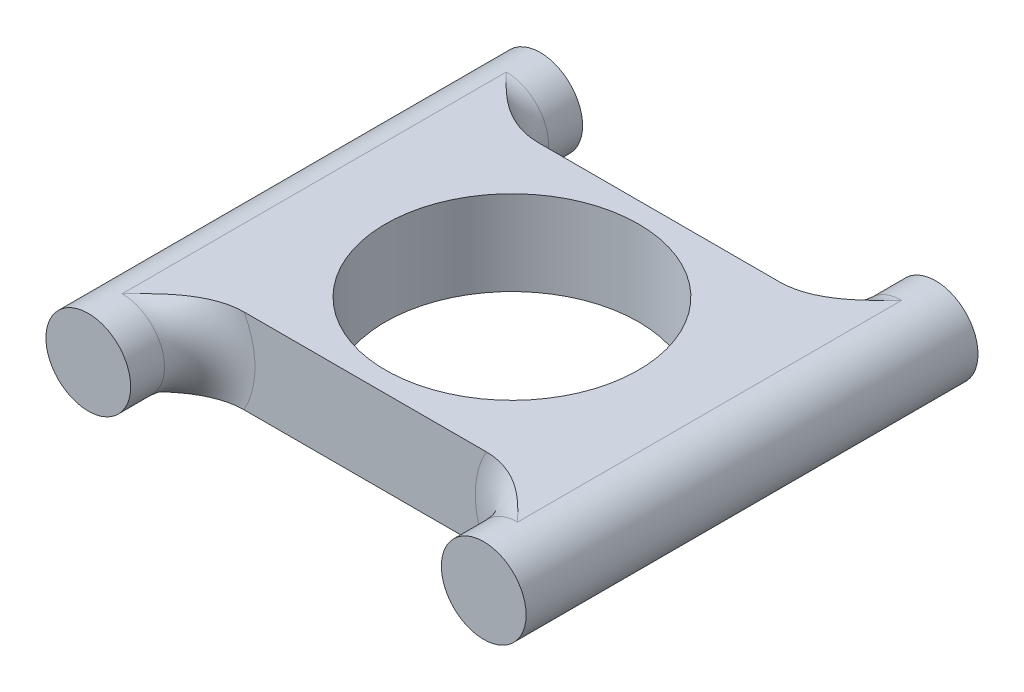
ISO-10303-21;
HEADER;
FILE_DESCRIPTION(('STEP AP214'),'2;1');
FILE_NAME('part.step','',(''),(''),'','','');
FILE_SCHEMA(('AUTOMOTIVE_DESIGN { 1 0 10303 214 1 1 1 1 }'));
ENDSEC;
DATA;
#1=APPLICATION_CONTEXT('core data for automotive mechanical design processes');
#2=APPLICATION_PROTOCOL_DEFINITION('international standard','automotive_design',2000,#1);
#3=PRODUCT_CONTEXT('',#1,'mechanical');
#4=PRODUCT('Part','Part','',(#3));
#5=PRODUCT_RELATED_PRODUCT_CATEGORY('part','',(#4));
#6=PRODUCT_DEFINITION_FORMATION('','',#4);
#7=PRODUCT_DEFINITION_CONTEXT('part definition',#1,'design');
#8=PRODUCT_DEFINITION('design','',#6,#7);
#9=PRODUCT_DEFINITION_SHAPE('','',#8);
#10=(LENGTH_UNIT() NAMED_UNIT(*) SI_UNIT(.MILLI.,.METRE.));
#11=(NAMED_UNIT(*) PLANE_ANGLE_UNIT() SI_UNIT($,.RADIAN.));
#12=(NAMED_UNIT(*) SI_UNIT($,.STERADIAN.) SOLID_ANGLE_UNIT());
#13=UNCERTAINTY_MEASURE_WITH_UNIT(LENGTH_MEASURE(1.E-05),#10,'distance_accuracy_value','');
#14=(GEOMETRIC_REPRESENTATION_CONTEXT(3) GLOBAL_UNCERTAINTY_ASSIGNED_CONTEXT((#13)) GLOBAL_UNIT_ASSIGNED_CONTEXT((#10,
#11,#12)) REPRESENTATION_CONTEXT('',''));
#15=CARTESIAN_POINT('',(0.,0.,0.));
#16=DIRECTION('',(0.,0.,1.));
#17=DIRECTION('',(1.,0.,0.));
#18=AXIS2_PLACEMENT_3D('',#15,#16,#17);
#19=CARTESIAN_POINT('',(22.225,0.,-25.4));
#20=DIRECTION('',(0.,0.,1.));
#21=DIRECTION('',(1.,0.,0.));
#22=AXIS2_PLACEMENT_3D('',#19,#20,#21);
#23=CYLINDRICAL_SURFACE('',#22,4.7625);
#24=CARTESIAN_POINT('',(22.225,0.,-25.4));
#25=DIRECTION('',(0.,0.,1.));
#26=DIRECTION('',(1.,0.,0.));
#27=AXIS2_PLACEMENT_3D('',#24,#25,#26);
#28=CIRCLE('',#27,4.7625);
#29=CARTESIAN_POINT('',(26.9875,0.,-25.4));
#30=VERTEX_POINT('',#29);
#31=EDGE_CURVE('E122',#30,#30,#28,.T.);
#32=ORIENTED_EDGE('',*,*,#31,.T.);
#33=EDGE_LOOP('',(#32));
#34=FACE_BOUND('',#33,.T.);
#35=CARTESIAN_POINT('',(22.225,0.,25.4));
#36=DIRECTION('',(0.,0.,1.));
#37=DIRECTION('',(1.,0.,0.));
#38=AXIS2_PLACEMENT_3D('',#35,#36,#37);
#39=CIRCLE('',#38,4.7625);
#40=CARTESIAN_POINT('',(26.9875,0.,25.4));
#41=VERTEX_POINT('',#40);
#42=EDGE_CURVE('E208',#41,#41,#39,.T.);
#43=ORIENTED_EDGE('',*,*,#42,.F.);
#44=EDGE_LOOP('',(#43));
#45=FACE_BOUND('',#44,.T.);
#46=CARTESIAN_POINT('',(22.225,0.,21.59));
#47=DIRECTION('',(0.,0.,1.));
#48=DIRECTION('',(1.,0.,0.));
#49=AXIS2_PLACEMENT_3D('',#46,#47,#48);
#50=CIRCLE('',#49,4.7625);
#51=CARTESIAN_POINT('',(22.225,4.7625,21.59));
#52=VERTEX_POINT('',#51);
#53=CARTESIAN_POINT('',(22.225,-4.7625,21.59));
#54=VERTEX_POINT('',#53);
#55=EDGE_CURVE('E121',#52,#54,#50,.T.);
#56=ORIENTED_EDGE('',*,*,#55,.T.);
#57=DIRECTION('',(0.,0.,1.));
#58=VECTOR('',#57,1.);
#59=CARTESIAN_POINT('',(22.225,-4.7625,-16.51));
#60=LINE('',#59,#58);
#61=CARTESIAN_POINT('',(22.225,-4.7625,-21.59));
#62=VERTEX_POINT('',#61);
#63=EDGE_CURVE('E118',#62,#54,#60,.T.);
#64=ORIENTED_EDGE('',*,*,#63,.F.);
#65=CARTESIAN_POINT('',(22.225,0.,-21.59));
#66=DIRECTION('',(0.,0.,1.));
#67=DIRECTION('',(1.,0.,0.));
#68=AXIS2_PLACEMENT_3D('',#65,#66,#67);
#69=CIRCLE('',#68,4.7625);
#70=CARTESIAN_POINT('',(22.225,4.7625,-21.59));
#71=VERTEX_POINT('',#70);
#72=EDGE_CURVE('E117',#62,#71,#69,.F.);
#73=ORIENTED_EDGE('',*,*,#72,.T.);
#74=DIRECTION('',(0.,0.,1.));
#75=VECTOR('',#74,1.);
#76=CARTESIAN_POINT('',(22.225,4.7625,-16.51));
#77=LINE('',#76,#75);
#78=EDGE_CURVE('E104',#71,#52,#77,.T.);
#79=ORIENTED_EDGE('',*,*,#78,.T.);
#80=EDGE_LOOP('',(#56,#64,#73,#79));
#81=FACE_BOUND('',#80,.T.);
#82=ADVANCED_FACE('F35',(#34,#45,#81),#23,.T.);
#83=CARTESIAN_POINT('',(0.,0.,-25.4));
#84=DIRECTION('',(0.,0.,1.));
#85=DIRECTION('',(1.,0.,0.));
#86=AXIS2_PLACEMENT_3D('',#83,#84,#85);
#87=PLANE('',#86);
#88=ORIENTED_EDGE('',*,*,#31,.F.);
#89=EDGE_LOOP('',(#88));
#90=FACE_BOUND('',#89,.T.);
#91=ADVANCED_FACE('F198',(#90),#87,.F.);
#92=CARTESIAN_POINT('',(0.,0.,25.4));
#93=DIRECTION('',(0.,0.,1.));
#94=DIRECTION('',(1.,0.,0.));
#95=AXIS2_PLACEMENT_3D('',#92,#93,#94);
#96=PLANE('',#95);
#97=ORIENTED_EDGE('',*,*,#42,.T.);
#98=EDGE_LOOP('',(#97));
#99=FACE_BOUND('',#98,.T.);
#100=ADVANCED_FACE('F193',(#99),#96,.T.);
#101=CARTESIAN_POINT('',(0.,-4.7625,-16.51));
#102=DIRECTION('',(0.,-1.,0.));
#103=DIRECTION('',(0.,0.,-1.));
#104=AXIS2_PLACEMENT_3D('',#101,#102,#103);
#105=PLANE('',#104);
#106=CARTESIAN_POINT('',(0.,-4.7625,0.));
#107=DIRECTION('',(0.,-1.,0.));
#108=DIRECTION('',(0.,0.,-1.));
#109=AXIS2_PLACEMENT_3D('',#106,#107,#108);
#110=CIRCLE('',#109,14.224);
#111=CARTESIAN_POINT('',(0.,-4.7625,-14.224));
#112=VERTEX_POINT('',#111);
#113=EDGE_CURVE('E215',#112,#112,#110,.F.);
#114=ORIENTED_EDGE('',*,*,#113,.T.);
#115=EDGE_LOOP('',(#114));
#116=FACE_BOUND('',#115,.T.);
#117=ORIENTED_EDGE('',*,*,#63,.T.);
#118=CARTESIAN_POINT('',(13.6114409214309,-4.7625,16.51));
#119=CARTESIAN_POINT('',(13.8221815827632,-4.7625,16.5099696692144));
#120=CARTESIAN_POINT('',(14.0328089721244,-4.7625,16.5200389596855));
#121=CARTESIAN_POINT('',(14.452019061284,-4.7625,16.5590698553365));
#122=CARTESIAN_POINT('',(14.6606042548943,-4.7625,16.5880044158106));
#123=CARTESIAN_POINT('',(15.0721487375323,-4.7625,16.6630332638882));
#124=CARTESIAN_POINT('',(15.2751451173396,-4.7625,16.7089268525463));
#125=CARTESIAN_POINT('',(15.6769584459915,-4.7625,16.8165410192194));
#126=CARTESIAN_POINT('',(15.8757734582413,-4.7625,16.8782687634337));
#127=CARTESIAN_POINT('',(16.3375336924917,-4.7625,17.040428960488));
#128=CARTESIAN_POINT('',(16.5983876931518,-4.7625,17.1468352007165));
#129=CARTESIAN_POINT('',(17.1095668006947,-4.7625,17.3824027217244));
#130=CARTESIAN_POINT('',(17.3598888911098,-4.7625,17.5115704674531));
#131=CARTESIAN_POINT('',(17.8506370969367,-4.7625,17.7897451169998));
#132=CARTESIAN_POINT('',(18.0910146827634,-4.7625,17.9388370304067));
#133=CARTESIAN_POINT('',(18.5610852185684,-4.7625,18.2530988283948));
#134=CARTESIAN_POINT('',(18.7907732127708,-4.7625,18.4182760626476));
#135=CARTESIAN_POINT('',(19.3058749041058,-4.7625,18.8116302408039));
#136=CARTESIAN_POINT('',(19.587977526881,-4.7625,19.0441199136696));
#137=CARTESIAN_POINT('',(20.1388018035342,-4.7625,19.524530410991));
#138=CARTESIAN_POINT('',(20.4075159946807,-4.76250000000001,19.77245967205));
#139=CARTESIAN_POINT('',(21.198813497362,-4.76249999999998,20.5304356751708));
#140=CARTESIAN_POINT('',(21.7071263734145,-4.76249999999991,21.0551442064601));
#141=CARTESIAN_POINT('',(22.2183894935106,-4.7625,21.5831726974442));
#142=CARTESIAN_POINT('',(22.2216947516974,-4.7625,21.5865863534135));
#143=CARTESIAN_POINT('',(22.225,-4.7625,21.59));
#144=B_SPLINE_CURVE_WITH_KNOTS('',3,(#118,#119,#120,#121,#122,#123,#124,#125,#126,#127,#128,
#129,#130,#131,#132,#133,#134,#135,#136,#137,#138,#139,#140,#141,#142,#143),.UNSPECIFIED.,.F.,
.F.,(4,2,2,2,2,2,2,2,2,2,2,2,4),(0.,0.631815380621104,1.26272699460049,1.88639956680648,
2.51035489938029,3.35419795218178,4.19828106914679,5.04608799056987,5.89428412417444,
6.99014122348054,8.08660247388573,10.2772987029609,10.2915535267059),.UNSPECIFIED.);
#145=CARTESIAN_POINT('',(13.6114409214309,-4.7625,16.51));
#146=VERTEX_POINT('',#145);
#147=EDGE_CURVE('E133',#54,#146,#144,.F.);
#148=ORIENTED_EDGE('',*,*,#147,.T.);
#149=DIRECTION('',(1.,0.,0.));
#150=VECTOR('',#149,1.);
#151=CARTESIAN_POINT('',(0.,-4.7625,16.51));
#152=LINE('',#151,#150);
#153=CARTESIAN_POINT('',(-13.6114409214309,-4.7625,16.51));
#154=VERTEX_POINT('',#153);
#155=EDGE_CURVE('E233',#154,#146,#152,.T.);
#156=ORIENTED_EDGE('',*,*,#155,.F.);
#157=CARTESIAN_POINT('',(-13.6114409214309,-4.7625,16.51));
#158=CARTESIAN_POINT('',(-13.8221815827643,-4.7625,16.5099696692144));
#159=CARTESIAN_POINT('',(-14.0328089721265,-4.7625,16.5200389596856));
#160=CARTESIAN_POINT('',(-14.4520190612882,-4.7625,16.559069855337));
#161=CARTESIAN_POINT('',(-14.6606042548995,-4.7625,16.5880044158114));
#162=CARTESIAN_POINT('',(-15.0721487375375,-4.7625,16.6630332638893));
#163=CARTESIAN_POINT('',(-15.2751451173438,-4.7625,16.7089268525473));
#164=CARTESIAN_POINT('',(-15.6769584459936,-4.7625,16.8165410192201));
#165=CARTESIAN_POINT('',(-15.8757734582423,-4.7625,16.878268763434));
#166=CARTESIAN_POINT('',(-16.3375336924909,-4.7625,17.0404289604877));
#167=CARTESIAN_POINT('',(-16.5983876931501,-4.7625,17.1468352007158));
#168=CARTESIAN_POINT('',(-17.1095668006915,-4.7625,17.3824027217228));
#169=CARTESIAN_POINT('',(-17.359888891106,-4.7625,17.5115704674511));
#170=CARTESIAN_POINT('',(-17.8506370969332,-4.7625,17.7897451169976));
#171=CARTESIAN_POINT('',(-18.0910146827608,-4.7625,17.9388370304049));
#172=CARTESIAN_POINT('',(-18.5610852185672,-4.7625,18.253098828394));
#173=CARTESIAN_POINT('',(-18.79077321277,-4.7625,18.4182760626474));
#174=CARTESIAN_POINT('',(-19.3058749041064,-4.7625,18.8116302408037));
#175=CARTESIAN_POINT('',(-19.587977526883,-4.7625,19.0441199136684));
#176=CARTESIAN_POINT('',(-20.1388018035338,-4.7625,19.5245304109935));
#177=CARTESIAN_POINT('',(-20.4075159946765,-4.7625,19.7724596720573));
#178=CARTESIAN_POINT('',(-21.1988134973752,-4.7625,20.5304356751609));
#179=CARTESIAN_POINT('',(-21.7071263734794,-4.7625,21.0551442063987));
#180=CARTESIAN_POINT('',(-22.2183894935114,-4.7625,21.5831726974433));
#181=CARTESIAN_POINT('',(-22.2216947516978,-4.7625,21.5865863534131));
#182=CARTESIAN_POINT('',(-22.225,-4.7625,21.59));
#183=B_SPLINE_CURVE_WITH_KNOTS('',3,(#157,#158,#159,#160,#161,#162,#163,#164,#165,#166,#167,
#168,#169,#170,#171,#172,#173,#174,#175,#176,#177,#178,#179,#180,#181,#182),.UNSPECIFIED.,.F.,
.F.,(4,2,2,2,2,2,2,2,2,2,2,2,4),(0.,0.631815380624232,1.26272699460688,1.88639956680974,
2.51035489938029,3.35419795217904,4.1982810691417,5.04608799056771,5.89428412417444,
6.99014122348127,8.0866024738889,10.2772987029609,10.2915535267059),.UNSPECIFIED.);
#184=CARTESIAN_POINT('',(-22.225,-4.7625,21.59));
#185=VERTEX_POINT('',#184);
#186=EDGE_CURVE('E174',#154,#185,#183,.T.);
#187=ORIENTED_EDGE('',*,*,#186,.T.);
#188=DIRECTION('',(0.,0.,1.));
#189=VECTOR('',#188,1.);
#190=CARTESIAN_POINT('',(-22.225,-4.7625,-16.51));
#191=LINE('',#190,#189);
#192=CARTESIAN_POINT('',(-22.225,-4.7625,-21.59));
#193=VERTEX_POINT('',#192);
#194=EDGE_CURVE('E225',#193,#185,#191,.T.);
#195=ORIENTED_EDGE('',*,*,#194,.F.);
#196=CARTESIAN_POINT('',(-13.6114409214309,-4.7625,-16.51));
#197=CARTESIAN_POINT('',(-13.8221815827643,-4.7625,-16.5099696692144));
#198=CARTESIAN_POINT('',(-14.0328089721265,-4.7625,-16.5200389596856));
#199=CARTESIAN_POINT('',(-14.4520190612882,-4.7625,-16.559069855337));
#200=CARTESIAN_POINT('',(-14.6606042548995,-4.7625,-16.5880044158114));
#201=CARTESIAN_POINT('',(-15.0721487375375,-4.7625,-16.6630332638893));
#202=CARTESIAN_POINT('',(-15.2751451173438,-4.7625,-16.7089268525473));
#203=CARTESIAN_POINT('',(-15.6769584459936,-4.7625,-16.81654101922));
#204=CARTESIAN_POINT('',(-15.8757734582423,-4.7625,-16.878268763434));
#205=CARTESIAN_POINT('',(-16.3375336924909,-4.7625,-17.0404289604877));
#206=CARTESIAN_POINT('',(-16.5983876931501,-4.7625,-17.1468352007158));
#207=CARTESIAN_POINT('',(-17.1095668006915,-4.7625,-17.3824027217228));
#208=CARTESIAN_POINT('',(-17.359888891106,-4.7625,-17.5115704674511));
#209=CARTESIAN_POINT('',(-17.8506370969332,-4.7625,-17.7897451169976));
#210=CARTESIAN_POINT('',(-18.0910146827608,-4.7625,-17.9388370304049));
#211=CARTESIAN_POINT('',(-18.5610852185672,-4.7625,-18.253098828394));
#212=CARTESIAN_POINT('',(-18.79077321277,-4.7625,-18.4182760626474));
#213=CARTESIAN_POINT('',(-19.3058749041064,-4.7625,-18.8116302408037));
#214=CARTESIAN_POINT('',(-19.587977526883,-4.7625,-19.0441199136683));
#215=CARTESIAN_POINT('',(-20.1388018035338,-4.7625,-19.5245304109935));
#216=CARTESIAN_POINT('',(-20.4075159946765,-4.7625,-19.7724596720573));
#217=CARTESIAN_POINT('',(-21.1988134973752,-4.7625,-20.5304356751609));
#218=CARTESIAN_POINT('',(-21.7071263734794,-4.7625,-21.0551442063987));
#219=CARTESIAN_POINT('',(-22.2183894935114,-4.7625,-21.5831726974433));
#220=CARTESIAN_POINT('',(-22.2216947516978,-4.7625,-21.5865863534131));
#221=CARTESIAN_POINT('',(-22.225,-4.7625,-21.59));
#222=B_SPLINE_CURVE_WITH_KNOTS('',3,(#196,#197,#198,#199,#200,#201,#202,#203,#204,#205,#206,
#207,#208,#209,#210,#211,#212,#213,#214,#215,#216,#217,#218,#219,#220,#221),.UNSPECIFIED.,.F.,
.F.,(4,2,2,2,2,2,2,2,2,2,2,2,4),(0.,0.631815380624232,1.26272699460688,1.88639956680974,
2.51035489938029,3.35419795217904,4.19828106914171,5.04608799056772,5.89428412417444,
6.99014122348127,8.0866024738889,10.2772987029609,10.2915535267059),.UNSPECIFIED.);
#223=CARTESIAN_POINT('',(-13.6114409214309,-4.7625,-16.51));
#224=VERTEX_POINT('',#223);
#225=EDGE_CURVE('E184',#193,#224,#222,.F.);
#226=ORIENTED_EDGE('',*,*,#225,.T.);
#227=DIRECTION('',(1.,0.,0.));
#228=VECTOR('',#227,1.);
#229=CARTESIAN_POINT('',(0.,-4.7625,-16.51));
#230=LINE('',#229,#228);
#231=CARTESIAN_POINT('',(13.6114409214309,-4.7625,-16.51));
#232=VERTEX_POINT('',#231);
#233=EDGE_CURVE('E114',#224,#232,#230,.T.);
#234=ORIENTED_EDGE('',*,*,#233,.T.);
#235=CARTESIAN_POINT('',(13.6114409214309,-4.7625,-16.51));
#236=CARTESIAN_POINT('',(13.8221815827635,-4.7625,-16.5099696692144));
#237=CARTESIAN_POINT('',(14.032808972125,-4.7625,-16.5200389596855));
#238=CARTESIAN_POINT('',(14.452019061285,-4.7625,-16.5590698553366));
#239=CARTESIAN_POINT('',(14.6606042548956,-4.7625,-16.5880044158108));
#240=CARTESIAN_POINT('',(15.0721487375336,-4.7625,-16.6630332638885));
#241=CARTESIAN_POINT('',(15.2751451173406,-4.7625,-16.7089268525465));
#242=CARTESIAN_POINT('',(15.6769584459921,-4.7625,-16.8165410192196));
#243=CARTESIAN_POINT('',(15.8757734582415,-4.7625,-16.8782687634337));
#244=CARTESIAN_POINT('',(16.3375336924915,-4.7625,-17.0404289604879));
#245=CARTESIAN_POINT('',(16.5983876931514,-4.7625,-17.1468352007164));
#246=CARTESIAN_POINT('',(17.1095668006939,-4.7625,-17.382402721724));
#247=CARTESIAN_POINT('',(17.3598888911089,-4.7625,-17.5115704674526));
#248=CARTESIAN_POINT('',(17.8506370969358,-4.7625,-17.7897451169992));
#249=CARTESIAN_POINT('',(18.0910146827627,-4.7625,-17.9388370304062));
#250=CARTESIAN_POINT('',(18.5610852185681,-4.7625,-18.2530988283946));
#251=CARTESIAN_POINT('',(18.7907732127706,-4.7625,-18.4182760626476));
#252=CARTESIAN_POINT('',(19.305874904106,-4.7625,-18.8116302408039));
#253=CARTESIAN_POINT('',(19.5879775268815,-4.7625,-19.0441199136692));
#254=CARTESIAN_POINT('',(20.1388018035341,-4.7625,-19.5245304109916));
#255=CARTESIAN_POINT('',(20.4075159946796,-4.76250000000001,-19.7724596720518));
#256=CARTESIAN_POINT('',(21.1988134973652,-4.76249999999998,-20.5304356751683));
#257=CARTESIAN_POINT('',(21.7071263734306,-4.76249999999991,-21.0551442064448));
#258=CARTESIAN_POINT('',(22.2183894935107,-4.7625,-21.583172697444));
#259=CARTESIAN_POINT('',(22.2216947516975,-4.7625,-21.5865863534134));
#260=CARTESIAN_POINT('',(22.225,-4.7625,-21.59));
#261=B_SPLINE_CURVE_WITH_KNOTS('',3,(#235,#236,#237,#238,#239,#240,#241,#242,#243,#244,#245,
#246,#247,#248,#249,#250,#251,#252,#253,#254,#255,#256,#257,#258,#259,#260),.UNSPECIFIED.,.F.,
.F.,(4,2,2,2,2,2,2,2,2,2,2,2,4),(0.,0.631815380621884,1.26272699460208,1.8863995668073,
2.51035489938029,3.3541979521811,4.19828106914553,5.04608799056932,5.89428412417443,
6.9901412234807,8.08660247388649,10.2772987029609,10.2915535267059),.UNSPECIFIED.);
#262=EDGE_CURVE('E48',#232,#62,#261,.T.);
#263=ORIENTED_EDGE('',*,*,#262,.T.);
#264=EDGE_LOOP('',(#117,#148,#156,#187,#195,#226,#234,#263));
#265=FACE_BOUND('',#264,.T.);
#266=ADVANCED_FACE('F150',(#116,#265),#105,.T.);
#267=CARTESIAN_POINT('',(0.,4.7625,-16.51));
#268=DIRECTION('',(0.,-1.,0.));
#269=DIRECTION('',(0.,0.,-1.));
#270=AXIS2_PLACEMENT_3D('',#267,#268,#269);
#271=PLANE('',#270);
#272=CARTESIAN_POINT('',(0.,4.7625,0.));
#273=DIRECTION('',(0.,-1.,0.));
#274=DIRECTION('',(0.,0.,-1.));
#275=AXIS2_PLACEMENT_3D('',#272,#273,#274);
#276=CIRCLE('',#275,14.224);
#277=CARTESIAN_POINT('',(0.,4.7625,-14.224));
#278=VERTEX_POINT('',#277);
#279=EDGE_CURVE('E213',#278,#278,#276,.F.);
#280=ORIENTED_EDGE('',*,*,#279,.F.);
#281=EDGE_LOOP('',(#280));
#282=FACE_BOUND('',#281,.T.);
#283=DIRECTION('',(0.,0.,1.));
#284=VECTOR('',#283,1.);
#285=CARTESIAN_POINT('',(-22.225,4.7625,-16.51));
#286=LINE('',#285,#284);
#287=CARTESIAN_POINT('',(-22.225,4.7625,-21.59));
#288=VERTEX_POINT('',#287);
#289=CARTESIAN_POINT('',(-22.225,4.7625,21.59));
#290=VERTEX_POINT('',#289);
#291=EDGE_CURVE('E113',#288,#290,#286,.T.);
#292=ORIENTED_EDGE('',*,*,#291,.T.);
#293=CARTESIAN_POINT('',(-13.6114409214309,4.7625,16.51));
#294=CARTESIAN_POINT('',(-13.8221815827643,4.7625,16.5099696692144));
#295=CARTESIAN_POINT('',(-14.0328089721265,4.7625,16.5200389596856));
#296=CARTESIAN_POINT('',(-14.4520190612882,4.7625,16.559069855337));
#297=CARTESIAN_POINT('',(-14.6606042548995,4.7625,16.5880044158114));
#298=CARTESIAN_POINT('',(-15.0721487375375,4.7625,16.6630332638893));
#299=CARTESIAN_POINT('',(-15.2751451173438,4.7625,16.7089268525473));
#300=CARTESIAN_POINT('',(-15.6769584459936,4.7625,16.8165410192201));
#301=CARTESIAN_POINT('',(-15.8757734582423,4.7625,16.878268763434));
#302=CARTESIAN_POINT('',(-16.3375336924909,4.7625,17.0404289604877));
#303=CARTESIAN_POINT('',(-16.5983876931501,4.7625,17.1468352007158));
#304=CARTESIAN_POINT('',(-17.1095668006915,4.7625,17.3824027217228));
#305=CARTESIAN_POINT('',(-17.359888891106,4.7625,17.5115704674511));
#306=CARTESIAN_POINT('',(-17.8506370969332,4.7625,17.7897451169976));
#307=CARTESIAN_POINT('',(-18.0910146827608,4.7625,17.9388370304049));
#308=CARTESIAN_POINT('',(-18.5610852185672,4.7625,18.253098828394));
#309=CARTESIAN_POINT('',(-18.79077321277,4.7625,18.4182760626474));
#310=CARTESIAN_POINT('',(-19.3058749041064,4.7625,18.8116302408037));
#311=CARTESIAN_POINT('',(-19.587977526883,4.7625,19.0441199136684));
#312=CARTESIAN_POINT('',(-20.1388018035338,4.7625,19.5245304109935));
#313=CARTESIAN_POINT('',(-20.4075159946765,4.7625,19.7724596720573));
#314=CARTESIAN_POINT('',(-21.1988134973752,4.7625,20.5304356751609));
#315=CARTESIAN_POINT('',(-21.7071263734794,4.7625,21.0551442063987));
#316=CARTESIAN_POINT('',(-22.2183894935114,4.7625,21.5831726974433));
#317=CARTESIAN_POINT('',(-22.2216947516978,4.7625,21.5865863534131));
#318=CARTESIAN_POINT('',(-22.225,4.7625,21.59));
#319=B_SPLINE_CURVE_WITH_KNOTS('',3,(#293,#294,#295,#296,#297,#298,#299,#300,#301,#302,#303,
#304,#305,#306,#307,#308,#309,#310,#311,#312,#313,#314,#315,#316,#317,#318),.UNSPECIFIED.,.F.,
.F.,(4,2,2,2,2,2,2,2,2,2,2,2,4),(0.,0.631815380624232,1.26272699460688,1.88639956680974,
2.51035489938029,3.35419795217904,4.1982810691417,5.04608799056771,5.89428412417444,
6.99014122348127,8.0866024738889,10.2772987029609,10.2915535267059),.UNSPECIFIED.);
#320=CARTESIAN_POINT('',(-13.6114409214309,4.7625,16.51));
#321=VERTEX_POINT('',#320);
#322=EDGE_CURVE('E169',#290,#321,#319,.F.);
#323=ORIENTED_EDGE('',*,*,#322,.T.);
#324=DIRECTION('',(1.,0.,0.));
#325=VECTOR('',#324,1.);
#326=CARTESIAN_POINT('',(0.,4.7625,16.51));
#327=LINE('',#326,#325);
#328=CARTESIAN_POINT('',(13.6114409214309,4.7625,16.51));
#329=VERTEX_POINT('',#328);
#330=EDGE_CURVE('E249',#321,#329,#327,.T.);
#331=ORIENTED_EDGE('',*,*,#330,.T.);
#332=CARTESIAN_POINT('',(13.6114409214309,4.7625,16.51));
#333=CARTESIAN_POINT('',(13.8221815827632,4.7625,16.5099696692144));
#334=CARTESIAN_POINT('',(14.0328089721244,4.7625,16.5200389596855));
#335=CARTESIAN_POINT('',(14.452019061284,4.7625,16.5590698553365));
#336=CARTESIAN_POINT('',(14.6606042548943,4.7625,16.5880044158106));
#337=CARTESIAN_POINT('',(15.0721487375323,4.7625,16.6630332638882));
#338=CARTESIAN_POINT('',(15.2751451173396,4.7625,16.7089268525463));
#339=CARTESIAN_POINT('',(15.6769584459915,4.7625,16.8165410192194));
#340=CARTESIAN_POINT('',(15.8757734582413,4.7625,16.8782687634337));
#341=CARTESIAN_POINT('',(16.3375336924917,4.7625,17.040428960488));
#342=CARTESIAN_POINT('',(16.5983876931518,4.7625,17.1468352007165));
#343=CARTESIAN_POINT('',(17.1095668006947,4.7625,17.3824027217244));
#344=CARTESIAN_POINT('',(17.3598888911098,4.7625,17.5115704674531));
#345=CARTESIAN_POINT('',(17.8506370969367,4.7625,17.7897451169998));
#346=CARTESIAN_POINT('',(18.0910146827634,4.7625,17.9388370304067));
#347=CARTESIAN_POINT('',(18.5610852185684,4.7625,18.2530988283948));
#348=CARTESIAN_POINT('',(18.7907732127708,4.7625,18.4182760626476));
#349=CARTESIAN_POINT('',(19.3058749041058,4.7625,18.8116302408039));
#350=CARTESIAN_POINT('',(19.587977526881,4.7625,19.0441199136696));
#351=CARTESIAN_POINT('',(20.1388018035342,4.7625,19.524530410991));
#352=CARTESIAN_POINT('',(20.4075159946807,4.76250000000001,19.77245967205));
#353=CARTESIAN_POINT('',(21.198813497362,4.76249999999998,20.5304356751708));
#354=CARTESIAN_POINT('',(21.7071263734145,4.76249999999991,21.0551442064601));
#355=CARTESIAN_POINT('',(22.2183894935106,4.7625,21.5831726974442));
#356=CARTESIAN_POINT('',(22.2216947516974,4.7625,21.5865863534135));
#357=CARTESIAN_POINT('',(22.225,4.7625,21.59));
#358=B_SPLINE_CURVE_WITH_KNOTS('',3,(#332,#333,#334,#335,#336,#337,#338,#339,#340,#341,#342,
#343,#344,#345,#346,#347,#348,#349,#350,#351,#352,#353,#354,#355,#356,#357),.UNSPECIFIED.,.F.,
.F.,(4,2,2,2,2,2,2,2,2,2,2,2,4),(0.,0.631815380621104,1.26272699460049,1.88639956680648,
2.51035489938029,3.35419795218178,4.19828106914679,5.04608799056987,5.89428412417444,
6.99014122348054,8.08660247388573,10.2772987029609,10.2915535267059),.UNSPECIFIED.);
#359=EDGE_CURVE('E109',#329,#52,#358,.T.);
#360=ORIENTED_EDGE('',*,*,#359,.T.);
#361=ORIENTED_EDGE('',*,*,#78,.F.);
#362=CARTESIAN_POINT('',(13.6114409214309,4.7625,-16.51));
#363=CARTESIAN_POINT('',(13.8221815827635,4.7625,-16.5099696692144));
#364=CARTESIAN_POINT('',(14.032808972125,4.7625,-16.5200389596855));
#365=CARTESIAN_POINT('',(14.452019061285,4.7625,-16.5590698553366));
#366=CARTESIAN_POINT('',(14.6606042548956,4.7625,-16.5880044158108));
#367=CARTESIAN_POINT('',(15.0721487375336,4.7625,-16.6630332638885));
#368=CARTESIAN_POINT('',(15.2751451173406,4.7625,-16.7089268525465));
#369=CARTESIAN_POINT('',(15.6769584459921,4.7625,-16.8165410192196));
#370=CARTESIAN_POINT('',(15.8757734582415,4.7625,-16.8782687634337));
#371=CARTESIAN_POINT('',(16.3375336924915,4.7625,-17.0404289604879));
#372=CARTESIAN_POINT('',(16.5983876931514,4.7625,-17.1468352007164));
#373=CARTESIAN_POINT('',(17.1095668006939,4.7625,-17.382402721724));
#374=CARTESIAN_POINT('',(17.3598888911089,4.7625,-17.5115704674526));
#375=CARTESIAN_POINT('',(17.8506370969358,4.7625,-17.7897451169992));
#376=CARTESIAN_POINT('',(18.0910146827627,4.7625,-17.9388370304062));
#377=CARTESIAN_POINT('',(18.5610852185681,4.7625,-18.2530988283946));
#378=CARTESIAN_POINT('',(18.7907732127706,4.7625,-18.4182760626476));
#379=CARTESIAN_POINT('',(19.305874904106,4.7625,-18.8116302408039));
#380=CARTESIAN_POINT('',(19.5879775268815,4.7625,-19.0441199136692));
#381=CARTESIAN_POINT('',(20.1388018035341,4.7625,-19.5245304109916));
#382=CARTESIAN_POINT('',(20.4075159946796,4.76250000000001,-19.7724596720518));
#383=CARTESIAN_POINT('',(21.1988134973652,4.76249999999998,-20.5304356751683));
#384=CARTESIAN_POINT('',(21.7071263734306,4.76249999999991,-21.0551442064448));
#385=CARTESIAN_POINT('',(22.2183894935107,4.7625,-21.583172697444));
#386=CARTESIAN_POINT('',(22.2216947516975,4.7625,-21.5865863534134));
#387=CARTESIAN_POINT('',(22.225,4.7625,-21.59));
#388=B_SPLINE_CURVE_WITH_KNOTS('',3,(#362,#363,#364,#365,#366,#367,#368,#369,#370,#371,#372,
#373,#374,#375,#376,#377,#378,#379,#380,#381,#382,#383,#384,#385,#386,#387),.UNSPECIFIED.,.F.,
.F.,(4,2,2,2,2,2,2,2,2,2,2,2,4),(0.,0.631815380621884,1.26272699460208,1.8863995668073,
2.51035489938029,3.3541979521811,4.19828106914553,5.04608799056932,5.89428412417443,
6.9901412234807,8.08660247388649,10.2772987029609,10.2915535267059),.UNSPECIFIED.);
#389=CARTESIAN_POINT('',(13.6114409214309,4.7625,-16.51));
#390=VERTEX_POINT('',#389);
#391=EDGE_CURVE('E11',#71,#390,#388,.F.);
#392=ORIENTED_EDGE('',*,*,#391,.T.);
#393=DIRECTION('',(1.,0.,0.));
#394=VECTOR('',#393,1.);
#395=CARTESIAN_POINT('',(0.,4.7625,-16.51));
#396=LINE('',#395,#394);
#397=CARTESIAN_POINT('',(-13.6114409214309,4.7625,-16.51));
#398=VERTEX_POINT('',#397);
#399=EDGE_CURVE('E231',#398,#390,#396,.T.);
#400=ORIENTED_EDGE('',*,*,#399,.F.);
#401=CARTESIAN_POINT('',(-13.6114409214309,4.7625,-16.51));
#402=CARTESIAN_POINT('',(-13.8221815827643,4.7625,-16.5099696692144));
#403=CARTESIAN_POINT('',(-14.0328089721265,4.7625,-16.5200389596856));
#404=CARTESIAN_POINT('',(-14.4520190612882,4.7625,-16.559069855337));
#405=CARTESIAN_POINT('',(-14.6606042548995,4.7625,-16.5880044158114));
#406=CARTESIAN_POINT('',(-15.0721487375375,4.7625,-16.6630332638893));
#407=CARTESIAN_POINT('',(-15.2751451173438,4.7625,-16.7089268525473));
#408=CARTESIAN_POINT('',(-15.6769584459936,4.7625,-16.81654101922));
#409=CARTESIAN_POINT('',(-15.8757734582423,4.7625,-16.878268763434));
#410=CARTESIAN_POINT('',(-16.3375336924909,4.7625,-17.0404289604877));
#411=CARTESIAN_POINT('',(-16.5983876931501,4.7625,-17.1468352007158));
#412=CARTESIAN_POINT('',(-17.1095668006915,4.7625,-17.3824027217228));
#413=CARTESIAN_POINT('',(-17.359888891106,4.7625,-17.5115704674511));
#414=CARTESIAN_POINT('',(-17.8506370969332,4.7625,-17.7897451169976));
#415=CARTESIAN_POINT('',(-18.0910146827608,4.7625,-17.9388370304049));
#416=CARTESIAN_POINT('',(-18.5610852185672,4.7625,-18.253098828394));
#417=CARTESIAN_POINT('',(-18.79077321277,4.7625,-18.4182760626474));
#418=CARTESIAN_POINT('',(-19.3058749041064,4.7625,-18.8116302408037));
#419=CARTESIAN_POINT('',(-19.587977526883,4.7625,-19.0441199136683));
#420=CARTESIAN_POINT('',(-20.1388018035338,4.7625,-19.5245304109935));
#421=CARTESIAN_POINT('',(-20.4075159946765,4.7625,-19.7724596720573));
#422=CARTESIAN_POINT('',(-21.1988134973752,4.7625,-20.5304356751609));
#423=CARTESIAN_POINT('',(-21.7071263734794,4.7625,-21.0551442063987));
#424=CARTESIAN_POINT('',(-22.2183894935114,4.7625,-21.5831726974433));
#425=CARTESIAN_POINT('',(-22.2216947516978,4.7625,-21.5865863534131));
#426=CARTESIAN_POINT('',(-22.225,4.7625,-21.59));
#427=B_SPLINE_CURVE_WITH_KNOTS('',3,(#401,#402,#403,#404,#405,#406,#407,#408,#409,#410,#411,
#412,#413,#414,#415,#416,#417,#418,#419,#420,#421,#422,#423,#424,#425,#426),.UNSPECIFIED.,.F.,
.F.,(4,2,2,2,2,2,2,2,2,2,2,2,4),(0.,0.631815380624232,1.26272699460688,1.88639956680974,
2.51035489938029,3.35419795217904,4.19828106914171,5.04608799056772,5.89428412417444,
6.99014122348127,8.0866024738889,10.2772987029609,10.2915535267059),.UNSPECIFIED.);
#428=EDGE_CURVE('E61',#398,#288,#427,.T.);
#429=ORIENTED_EDGE('',*,*,#428,.T.);
#430=EDGE_LOOP('',(#292,#323,#331,#360,#361,#392,#400,#429));
#431=FACE_BOUND('',#430,.T.);
#432=ADVANCED_FACE('F106',(#282,#431),#271,.F.);
#433=CARTESIAN_POINT('',(0.,0.,-16.51));
#434=DIRECTION('',(0.,0.,1.));
#435=DIRECTION('',(1.,0.,0.));
#436=AXIS2_PLACEMENT_3D('',#433,#434,#435);
#437=PLANE('',#436);
#438=ORIENTED_EDGE('',*,*,#233,.F.);
#439=CARTESIAN_POINT('',(-22.225,0.,-16.51));
#440=DIRECTION('',(0.,0.,1.));
#441=DIRECTION('',(1.,0.,0.));
#442=AXIS2_PLACEMENT_3D('',#439,#440,#441);
#443=CIRCLE('',#442,9.8425);
#444=EDGE_CURVE('E130',#224,#398,#443,.T.);
#445=ORIENTED_EDGE('',*,*,#444,.T.);
#446=ORIENTED_EDGE('',*,*,#399,.T.);
#447=CARTESIAN_POINT('',(22.225,0.,-16.51));
#448=DIRECTION('',(0.,0.,1.));
#449=DIRECTION('',(1.,0.,0.));
#450=AXIS2_PLACEMENT_3D('',#447,#448,#449);
#451=CIRCLE('',#450,9.8425);
#452=EDGE_CURVE('E126',#390,#232,#451,.T.);
#453=ORIENTED_EDGE('',*,*,#452,.T.);
#454=EDGE_LOOP('',(#438,#445,#446,#453));
#455=FACE_BOUND('',#454,.T.);
#456=ADVANCED_FACE('F191',(#455),#437,.F.);
#457=CARTESIAN_POINT('',(0.,0.,16.51));
#458=DIRECTION('',(0.,0.,1.));
#459=DIRECTION('',(1.,0.,0.));
#460=AXIS2_PLACEMENT_3D('',#457,#458,#459);
#461=PLANE('',#460);
#462=ORIENTED_EDGE('',*,*,#155,.T.);
#463=CARTESIAN_POINT('',(22.225,0.,16.51));
#464=DIRECTION('',(0.,0.,1.));
#465=DIRECTION('',(1.,0.,0.));
#466=AXIS2_PLACEMENT_3D('',#463,#464,#465);
#467=CIRCLE('',#466,9.8425);
#468=EDGE_CURVE('E220',#146,#329,#467,.F.);
#469=ORIENTED_EDGE('',*,*,#468,.T.);
#470=ORIENTED_EDGE('',*,*,#330,.F.);
#471=CARTESIAN_POINT('',(-22.225,0.,16.51));
#472=DIRECTION('',(0.,0.,1.));
#473=DIRECTION('',(1.,0.,0.));
#474=AXIS2_PLACEMENT_3D('',#471,#472,#473);
#475=CIRCLE('',#474,9.8425);
#476=EDGE_CURVE('E218',#321,#154,#475,.F.);
#477=ORIENTED_EDGE('',*,*,#476,.T.);
#478=EDGE_LOOP('',(#462,#469,#470,#477));
#479=FACE_BOUND('',#478,.T.);
#480=ADVANCED_FACE('F247',(#479),#461,.T.);
#481=CARTESIAN_POINT('',(-22.225,0.,-25.4));
#482=DIRECTION('',(0.,0.,1.));
#483=DIRECTION('',(1.,0.,0.));
#484=AXIS2_PLACEMENT_3D('',#481,#482,#483);
#485=CYLINDRICAL_SURFACE('',#484,4.7625);
#486=CARTESIAN_POINT('',(-22.225,0.,25.4));
#487=DIRECTION('',(0.,0.,1.));
#488=DIRECTION('',(1.,0.,0.));
#489=AXIS2_PLACEMENT_3D('',#486,#487,#488);
#490=CIRCLE('',#489,4.7625);
#491=CARTESIAN_POINT('',(-17.4625,0.,25.4));
#492=VERTEX_POINT('',#491);
#493=EDGE_CURVE('E250',#492,#492,#490,.T.);
#494=ORIENTED_EDGE('',*,*,#493,.F.);
#495=EDGE_LOOP('',(#494));
#496=FACE_BOUND('',#495,.T.);
#497=CARTESIAN_POINT('',(-22.225,0.,-25.4));
#498=DIRECTION('',(0.,0.,1.));
#499=DIRECTION('',(1.,0.,0.));
#500=AXIS2_PLACEMENT_3D('',#497,#498,#499);
#501=CIRCLE('',#500,4.7625);
#502=CARTESIAN_POINT('',(-17.4625,0.,-25.4));
#503=VERTEX_POINT('',#502);
#504=EDGE_CURVE('E255',#503,#503,#501,.T.);
#505=ORIENTED_EDGE('',*,*,#504,.T.);
#506=EDGE_LOOP('',(#505));
#507=FACE_BOUND('',#506,.T.);
#508=CARTESIAN_POINT('',(-22.225,0.,21.59));
#509=DIRECTION('',(0.,0.,1.));
#510=DIRECTION('',(1.,0.,0.));
#511=AXIS2_PLACEMENT_3D('',#508,#509,#510);
#512=CIRCLE('',#511,4.7625);
#513=EDGE_CURVE('E131',#185,#290,#512,.T.);
#514=ORIENTED_EDGE('',*,*,#513,.T.);
#515=ORIENTED_EDGE('',*,*,#291,.F.);
#516=CARTESIAN_POINT('',(-22.225,0.,-21.59));
#517=DIRECTION('',(0.,0.,1.));
#518=DIRECTION('',(1.,0.,0.));
#519=AXIS2_PLACEMENT_3D('',#516,#517,#518);
#520=CIRCLE('',#519,4.7625);
#521=EDGE_CURVE('E136',#288,#193,#520,.F.);
#522=ORIENTED_EDGE('',*,*,#521,.T.);
#523=ORIENTED_EDGE('',*,*,#194,.T.);
#524=EDGE_LOOP('',(#514,#515,#522,#523));
#525=FACE_BOUND('',#524,.T.);
#526=ADVANCED_FACE('F224',(#496,#507,#525),#485,.T.);
#527=CARTESIAN_POINT('',(-22.225,0.,-25.4));
#528=DIRECTION('',(0.,0.,1.));
#529=DIRECTION('',(1.,0.,0.));
#530=AXIS2_PLACEMENT_3D('',#527,#528,#529);
#531=PLANE('',#530);
#532=ORIENTED_EDGE('',*,*,#504,.F.);
#533=EDGE_LOOP('',(#532));
#534=FACE_BOUND('',#533,.T.);
#535=ADVANCED_FACE('F270',(#534),#531,.F.);
#536=CARTESIAN_POINT('',(-22.225,0.,25.4));
#537=DIRECTION('',(0.,0.,1.));
#538=DIRECTION('',(1.,0.,0.));
#539=AXIS2_PLACEMENT_3D('',#536,#537,#538);
#540=PLANE('',#539);
#541=ORIENTED_EDGE('',*,*,#493,.T.);
#542=EDGE_LOOP('',(#541));
#543=FACE_BOUND('',#542,.T.);
#544=ADVANCED_FACE('F264',(#543),#540,.T.);
#545=CARTESIAN_POINT('',(0.,16.51,0.));
#546=DIRECTION('',(0.,-1.,0.));
#547=DIRECTION('',(0.,0.,-1.));
#548=AXIS2_PLACEMENT_3D('',#545,#546,#547);
#549=CYLINDRICAL_SURFACE('',#548,14.224);
#550=ORIENTED_EDGE('',*,*,#113,.F.);
#551=EDGE_LOOP('',(#550));
#552=FACE_BOUND('',#551,.T.);
#553=ORIENTED_EDGE('',*,*,#279,.T.);
#554=EDGE_LOOP('',(#553));
#555=FACE_BOUND('',#554,.T.);
#556=ADVANCED_FACE('F159',(#552,#555),#549,.F.);
#557=CARTESIAN_POINT('',(22.225,0.,21.59));
#558=DIRECTION('',(0.,0.,1.));
#559=DIRECTION('',(1.,0.,0.));
#560=AXIS2_PLACEMENT_3D('',#557,#558,#559);
#561=TOROIDAL_SURFACE('',#560,9.8425,5.08);
#562=ORIENTED_EDGE('',*,*,#359,.F.);
#563=ORIENTED_EDGE('',*,*,#468,.F.);
#564=ORIENTED_EDGE('',*,*,#147,.F.);
#565=ORIENTED_EDGE('',*,*,#55,.F.);
#566=EDGE_LOOP('',(#562,#563,#564,#565));
#567=FACE_BOUND('',#566,.T.);
#568=ADVANCED_FACE('F153',(#567),#561,.F.);
#569=CARTESIAN_POINT('',(-22.225,0.,21.59));
#570=DIRECTION('',(0.,0.,1.));
#571=DIRECTION('',(1.,0.,0.));
#572=AXIS2_PLACEMENT_3D('',#569,#570,#571);
#573=TOROIDAL_SURFACE('',#572,9.8425,5.08);
#574=ORIENTED_EDGE('',*,*,#186,.F.);
#575=ORIENTED_EDGE('',*,*,#476,.F.);
#576=ORIENTED_EDGE('',*,*,#322,.F.);
#577=ORIENTED_EDGE('',*,*,#513,.F.);
#578=EDGE_LOOP('',(#574,#575,#576,#577));
#579=FACE_BOUND('',#578,.T.);
#580=ADVANCED_FACE('F158',(#579),#573,.F.);
#581=CARTESIAN_POINT('',(-22.225,0.,-21.59));
#582=DIRECTION('',(0.,0.,1.));
#583=DIRECTION('',(1.,0.,0.));
#584=AXIS2_PLACEMENT_3D('',#581,#582,#583);
#585=TOROIDAL_SURFACE('',#584,9.8425,5.08);
#586=ORIENTED_EDGE('',*,*,#225,.F.);
#587=ORIENTED_EDGE('',*,*,#521,.F.);
#588=ORIENTED_EDGE('',*,*,#428,.F.);
#589=ORIENTED_EDGE('',*,*,#444,.F.);
#590=EDGE_LOOP('',(#586,#587,#588,#589));
#591=FACE_BOUND('',#590,.T.);
#592=ADVANCED_FACE('F165',(#591),#585,.F.);
#593=CARTESIAN_POINT('',(22.225,0.,-21.59));
#594=DIRECTION('',(0.,0.,1.));
#595=DIRECTION('',(1.,0.,0.));
#596=AXIS2_PLACEMENT_3D('',#593,#594,#595);
#597=TOROIDAL_SURFACE('',#596,9.8425,5.08);
#598=ORIENTED_EDGE('',*,*,#391,.F.);
#599=ORIENTED_EDGE('',*,*,#72,.F.);
#600=ORIENTED_EDGE('',*,*,#262,.F.);
#601=ORIENTED_EDGE('',*,*,#452,.F.);
#602=EDGE_LOOP('',(#598,#599,#600,#601));
#603=FACE_BOUND('',#602,.T.);
#604=ADVANCED_FACE('F37',(#603),#597,.F.);
#605=CLOSED_SHELL('',(#82,#91,#100,#266,#432,#456,#480,#526,#535,#544,#556,#568,#580,#592,#604));
#606=MANIFOLD_SOLID_BREP('B2',#605);
#607=ADVANCED_BREP_SHAPE_REPRESENTATION('',(#18,#606),#14);
#608=SHAPE_DEFINITION_REPRESENTATION(#9,#607);
ENDSEC;
END-ISO-10303-21;
